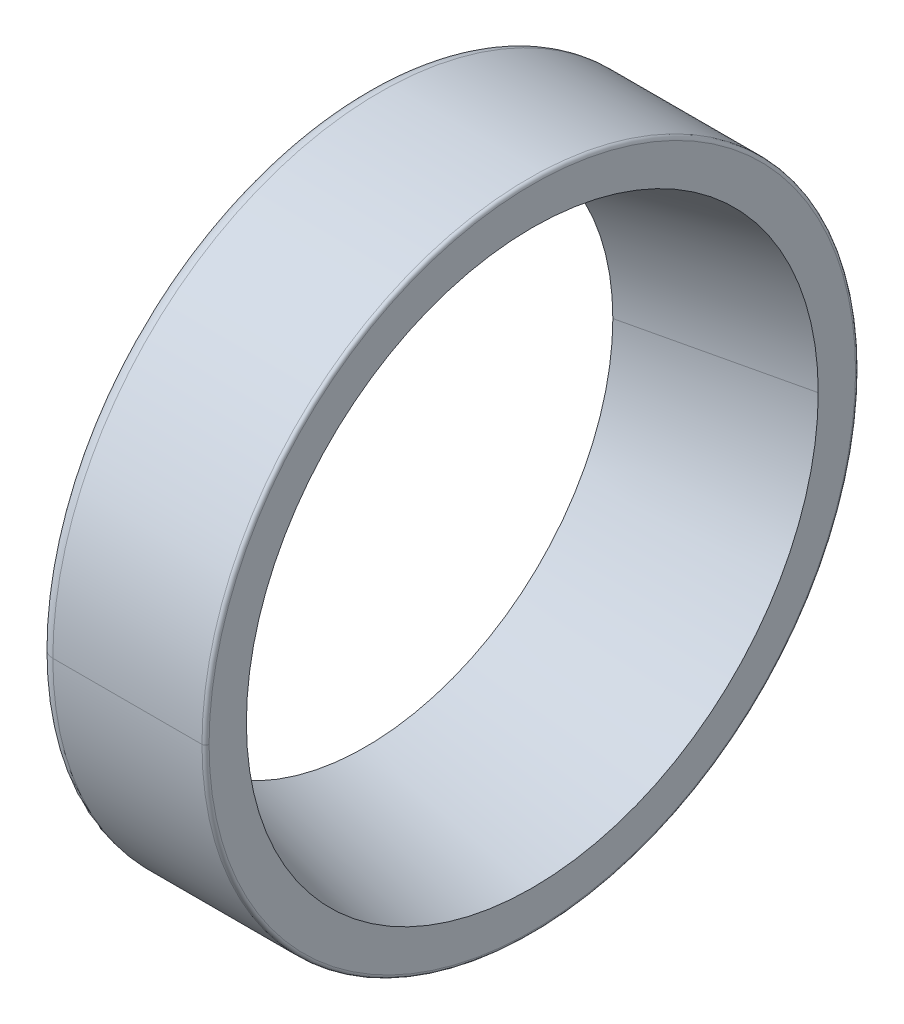
ISO-10303-21;
HEADER;
FILE_DESCRIPTION(('STEP AP214'),'2;1');
FILE_NAME('part.step','',(''),(''),'','','');
FILE_SCHEMA(('AUTOMOTIVE_DESIGN { 1 0 10303 214 1 1 1 1 }'));
ENDSEC;
DATA;
#1=APPLICATION_CONTEXT('core data for automotive mechanical design processes');
#2=APPLICATION_PROTOCOL_DEFINITION('international standard','automotive_design',2000,#1);
#3=PRODUCT_CONTEXT('',#1,'mechanical');
#4=PRODUCT('Part','Part','',(#3));
#5=PRODUCT_RELATED_PRODUCT_CATEGORY('part','',(#4));
#6=PRODUCT_DEFINITION_FORMATION('','',#4);
#7=PRODUCT_DEFINITION_CONTEXT('part definition',#1,'design');
#8=PRODUCT_DEFINITION('design','',#6,#7);
#9=PRODUCT_DEFINITION_SHAPE('','',#8);
#10=(LENGTH_UNIT() NAMED_UNIT(*) SI_UNIT(.MILLI.,.METRE.));
#11=(NAMED_UNIT(*) PLANE_ANGLE_UNIT() SI_UNIT($,.RADIAN.));
#12=(NAMED_UNIT(*) SI_UNIT($,.STERADIAN.) SOLID_ANGLE_UNIT());
#13=UNCERTAINTY_MEASURE_WITH_UNIT(LENGTH_MEASURE(1.E-05),#10,'distance_accuracy_value','');
#14=(GEOMETRIC_REPRESENTATION_CONTEXT(3) GLOBAL_UNCERTAINTY_ASSIGNED_CONTEXT((#13)) GLOBAL_UNIT_ASSIGNED_CONTEXT((#10,
#11,#12)) REPRESENTATION_CONTEXT('',''));
#15=CARTESIAN_POINT('',(0.,0.,0.));
#16=DIRECTION('',(0.,0.,1.));
#17=DIRECTION('',(1.,0.,0.));
#18=AXIS2_PLACEMENT_3D('',#15,#16,#17);
#19=CARTESIAN_POINT('',(10.75,0.,21.9035359271151));
#20=DIRECTION('',(1.,0.,0.));
#21=DIRECTION('',(0.,1.,0.));
#22=AXIS2_PLACEMENT_3D('',#19,#20,#21);
#23=PLANE('',#22);
#24=CARTESIAN_POINT('',(10.75,0.,0.));
#25=DIRECTION('',(-1.,0.,0.));
#26=DIRECTION('',(0.,0.,1.));
#27=AXIS2_PLACEMENT_3D('',#24,#25,#26);
#28=CIRCLE('',#27,23.245);
#29=CARTESIAN_POINT('',(10.75,0.,23.245));
#30=VERTEX_POINT('',#29);
#31=CARTESIAN_POINT('',(10.75,0.,-23.245));
#32=VERTEX_POINT('',#31);
#33=EDGE_CURVE('E61',#30,#32,#28,.T.);
#34=ORIENTED_EDGE('',*,*,#33,.F.);
#35=CARTESIAN_POINT('',(10.75,0.,0.));
#36=DIRECTION('',(-1.,0.,0.));
#37=DIRECTION('',(0.,0.,1.));
#38=AXIS2_PLACEMENT_3D('',#35,#36,#37);
#39=CIRCLE('',#38,23.245);
#40=EDGE_CURVE('E153',#32,#30,#39,.T.);
#41=ORIENTED_EDGE('',*,*,#40,.F.);
#42=EDGE_LOOP('',(#34,#41));
#43=FACE_BOUND('',#42,.T.);
#44=CARTESIAN_POINT('',(10.75,0.,0.));
#45=DIRECTION('',(-1.,0.,0.));
#46=DIRECTION('',(0.,0.,1.));
#47=AXIS2_PLACEMENT_3D('',#44,#45,#46);
#48=CIRCLE('',#47,20.5620718542302);
#49=CARTESIAN_POINT('',(10.75,0.,20.5620718542302));
#50=VERTEX_POINT('',#49);
#51=CARTESIAN_POINT('',(10.75,0.,-20.5620718542302));
#52=VERTEX_POINT('',#51);
#53=EDGE_CURVE('E11',#50,#52,#48,.T.);
#54=ORIENTED_EDGE('',*,*,#53,.T.);
#55=CARTESIAN_POINT('',(10.75,0.,0.));
#56=DIRECTION('',(-1.,0.,0.));
#57=DIRECTION('',(0.,0.,1.));
#58=AXIS2_PLACEMENT_3D('',#55,#56,#57);
#59=CIRCLE('',#58,20.5620718542302);
#60=EDGE_CURVE('E49',#52,#50,#59,.T.);
#61=ORIENTED_EDGE('',*,*,#60,.T.);
#62=EDGE_LOOP('',(#54,#61));
#63=FACE_BOUND('',#62,.T.);
#64=ADVANCED_FACE('F38',(#43,#63),#23,.T.);
#65=CARTESIAN_POINT('',(10.495,0.,0.));
#66=DIRECTION('',(-1.,0.,0.));
#67=DIRECTION('',(0.,0.,1.));
#68=AXIS2_PLACEMENT_3D('',#65,#66,#67);
#69=TOROIDAL_SURFACE('',#68,23.245,0.255);
#70=CARTESIAN_POINT('',(10.495,0.,23.245));
#71=DIRECTION('',(0.,-1.,0.));
#72=DIRECTION('',(0.,0.,1.));
#73=AXIS2_PLACEMENT_3D('',#70,#71,#72);
#74=CIRCLE('',#73,0.255);
#75=CARTESIAN_POINT('',(10.495,0.,23.5));
#76=VERTEX_POINT('',#75);
#77=EDGE_CURVE('E147',#30,#76,#74,.T.);
#78=ORIENTED_EDGE('',*,*,#77,.T.);
#79=CARTESIAN_POINT('',(10.495,0.,0.));
#80=DIRECTION('',(-1.,0.,0.));
#81=DIRECTION('',(0.,0.,1.));
#82=AXIS2_PLACEMENT_3D('',#79,#80,#81);
#83=CIRCLE('',#82,23.5);
#84=CARTESIAN_POINT('',(10.495,0.,-23.5));
#85=VERTEX_POINT('',#84);
#86=EDGE_CURVE('E128',#85,#76,#83,.T.);
#87=ORIENTED_EDGE('',*,*,#86,.F.);
#88=CARTESIAN_POINT('',(10.495,0.,-23.245));
#89=DIRECTION('',(0.,-1.,0.));
#90=DIRECTION('',(0.,0.,-1.));
#91=AXIS2_PLACEMENT_3D('',#88,#89,#90);
#92=CIRCLE('',#91,0.255);
#93=EDGE_CURVE('E155',#85,#32,#92,.T.);
#94=ORIENTED_EDGE('',*,*,#93,.T.);
#95=ORIENTED_EDGE('',*,*,#40,.T.);
#96=EDGE_LOOP('',(#78,#87,#94,#95));
#97=FACE_BOUND('',#96,.T.);
#98=ADVANCED_FACE('F184',(#97),#69,.T.);
#99=CARTESIAN_POINT('',(4.75,0.,0.));
#100=DIRECTION('',(1.,0.,0.));
#101=DIRECTION('',(0.,0.,1.));
#102=AXIS2_PLACEMENT_3D('',#99,#100,#101);
#103=CONICAL_SURFACE('',#102,19.1768529160807,0.226894352079104);
#104=DIRECTION('',(-0.974369716262934,0.,-0.224952563954469));
#105=VECTOR('',#104,1.);
#106=CARTESIAN_POINT('',(4.75,0.,19.1768529160807));
#107=LINE('',#106,#105);
#108=CARTESIAN_POINT('',(-1.25,0.,17.7916339779311));
#109=VERTEX_POINT('',#108);
#110=EDGE_CURVE('E172',#50,#109,#107,.T.);
#111=ORIENTED_EDGE('',*,*,#110,.F.);
#112=ORIENTED_EDGE('',*,*,#60,.F.);
#113=DIRECTION('',(0.974369716262934,0.,-0.224952563954469));
#114=VECTOR('',#113,1.);
#115=CARTESIAN_POINT('',(4.75,0.,-19.1768529160807));
#116=LINE('',#115,#114);
#117=CARTESIAN_POINT('',(-1.25,0.,-17.7916339779311));
#118=VERTEX_POINT('',#117);
#119=EDGE_CURVE('E148',#118,#52,#116,.T.);
#120=ORIENTED_EDGE('',*,*,#119,.F.);
#121=CARTESIAN_POINT('',(-1.25,0.,0.));
#122=DIRECTION('',(-1.,0.,0.));
#123=DIRECTION('',(0.,0.,1.));
#124=AXIS2_PLACEMENT_3D('',#121,#122,#123);
#125=CIRCLE('',#124,17.7916339779311);
#126=EDGE_CURVE('E42',#118,#109,#125,.T.);
#127=ORIENTED_EDGE('',*,*,#126,.T.);
#128=EDGE_LOOP('',(#111,#112,#120,#127));
#129=FACE_BOUND('',#128,.T.);
#130=ADVANCED_FACE('F204',(#129),#103,.F.);
#131=CARTESIAN_POINT('',(4.75,0.,0.));
#132=DIRECTION('',(1.,0.,0.));
#133=DIRECTION('',(0.,0.,1.));
#134=AXIS2_PLACEMENT_3D('',#131,#132,#133);
#135=CONICAL_SURFACE('',#134,19.1768529160807,0.226894352079104);
#136=ORIENTED_EDGE('',*,*,#110,.T.);
#137=CARTESIAN_POINT('',(-1.25,0.,0.));
#138=DIRECTION('',(-1.,0.,0.));
#139=DIRECTION('',(0.,0.,1.));
#140=AXIS2_PLACEMENT_3D('',#137,#138,#139);
#141=CIRCLE('',#140,17.7916339779311);
#142=EDGE_CURVE('E151',#109,#118,#141,.T.);
#143=ORIENTED_EDGE('',*,*,#142,.T.);
#144=ORIENTED_EDGE('',*,*,#119,.T.);
#145=ORIENTED_EDGE('',*,*,#53,.F.);
#146=EDGE_LOOP('',(#136,#143,#144,#145));
#147=FACE_BOUND('',#146,.T.);
#148=ADVANCED_FACE('F197',(#147),#135,.F.);
#149=CARTESIAN_POINT('',(10.495,0.,0.));
#150=DIRECTION('',(-1.,0.,0.));
#151=DIRECTION('',(0.,0.,1.));
#152=AXIS2_PLACEMENT_3D('',#149,#150,#151);
#153=TOROIDAL_SURFACE('',#152,23.245,0.255);
#154=ORIENTED_EDGE('',*,*,#77,.F.);
#155=ORIENTED_EDGE('',*,*,#33,.T.);
#156=ORIENTED_EDGE('',*,*,#93,.F.);
#157=CARTESIAN_POINT('',(10.495,0.,0.));
#158=DIRECTION('',(-1.,0.,0.));
#159=DIRECTION('',(0.,0.,1.));
#160=AXIS2_PLACEMENT_3D('',#157,#158,#159);
#161=CIRCLE('',#160,23.5);
#162=EDGE_CURVE('E124',#76,#85,#161,.T.);
#163=ORIENTED_EDGE('',*,*,#162,.F.);
#164=EDGE_LOOP('',(#154,#155,#156,#163));
#165=FACE_BOUND('',#164,.T.);
#166=ADVANCED_FACE('F190',(#165),#153,.T.);
#167=CARTESIAN_POINT('',(5.1325,0.,0.));
#168=DIRECTION('',(-1.,0.,0.));
#169=DIRECTION('',(0.,0.,1.));
#170=AXIS2_PLACEMENT_3D('',#167,#168,#169);
#171=CYLINDRICAL_SURFACE('',#170,23.5);
#172=DIRECTION('',(-1.,0.,0.));
#173=VECTOR('',#172,1.);
#174=CARTESIAN_POINT('',(5.1325,0.,23.5));
#175=LINE('',#174,#173);
#176=CARTESIAN_POINT('',(-0.23,0.,23.5));
#177=VERTEX_POINT('',#176);
#178=EDGE_CURVE('E140',#76,#177,#175,.T.);
#179=ORIENTED_EDGE('',*,*,#178,.T.);
#180=CARTESIAN_POINT('',(-0.23,0.,0.));
#181=DIRECTION('',(-1.,0.,0.));
#182=DIRECTION('',(0.,0.,1.));
#183=AXIS2_PLACEMENT_3D('',#180,#181,#182);
#184=CIRCLE('',#183,23.5);
#185=CARTESIAN_POINT('',(-0.23,0.,-23.5));
#186=VERTEX_POINT('',#185);
#187=EDGE_CURVE('E132',#186,#177,#184,.T.);
#188=ORIENTED_EDGE('',*,*,#187,.F.);
#189=DIRECTION('',(1.,0.,0.));
#190=VECTOR('',#189,1.);
#191=CARTESIAN_POINT('',(5.1325,0.,-23.5));
#192=LINE('',#191,#190);
#193=EDGE_CURVE('E144',#186,#85,#192,.T.);
#194=ORIENTED_EDGE('',*,*,#193,.T.);
#195=ORIENTED_EDGE('',*,*,#86,.T.);
#196=EDGE_LOOP('',(#179,#188,#194,#195));
#197=FACE_BOUND('',#196,.T.);
#198=ADVANCED_FACE('F40',(#197),#171,.T.);
#199=CARTESIAN_POINT('',(-1.25,0.,20.1358169889656));
#200=DIRECTION('',(-1.,0.,0.));
#201=DIRECTION('',(0.,0.,1.));
#202=AXIS2_PLACEMENT_3D('',#199,#200,#201);
#203=PLANE('',#202);
#204=ORIENTED_EDGE('',*,*,#142,.F.);
#205=ORIENTED_EDGE('',*,*,#126,.F.);
#206=EDGE_LOOP('',(#204,#205));
#207=FACE_BOUND('',#206,.T.);
#208=CARTESIAN_POINT('',(-1.25,0.,0.));
#209=DIRECTION('',(-1.,0.,0.));
#210=DIRECTION('',(0.,0.,1.));
#211=AXIS2_PLACEMENT_3D('',#208,#209,#210);
#212=CIRCLE('',#211,22.48);
#213=CARTESIAN_POINT('',(-1.25,0.,22.48));
#214=VERTEX_POINT('',#213);
#215=CARTESIAN_POINT('',(-1.25,0.,-22.48));
#216=VERTEX_POINT('',#215);
#217=EDGE_CURVE('E123',#214,#216,#212,.T.);
#218=ORIENTED_EDGE('',*,*,#217,.T.);
#219=CARTESIAN_POINT('',(-1.25,0.,0.));
#220=DIRECTION('',(-1.,0.,0.));
#221=DIRECTION('',(0.,0.,1.));
#222=AXIS2_PLACEMENT_3D('',#219,#220,#221);
#223=CIRCLE('',#222,22.48);
#224=EDGE_CURVE('E115',#216,#214,#223,.T.);
#225=ORIENTED_EDGE('',*,*,#224,.T.);
#226=EDGE_LOOP('',(#218,#225));
#227=FACE_BOUND('',#226,.T.);
#228=ADVANCED_FACE('F126',(#207,#227),#203,.T.);
#229=CARTESIAN_POINT('',(5.1325,0.,0.));
#230=DIRECTION('',(-1.,0.,0.));
#231=DIRECTION('',(0.,0.,1.));
#232=AXIS2_PLACEMENT_3D('',#229,#230,#231);
#233=CYLINDRICAL_SURFACE('',#232,23.5);
#234=ORIENTED_EDGE('',*,*,#178,.F.);
#235=ORIENTED_EDGE('',*,*,#162,.T.);
#236=ORIENTED_EDGE('',*,*,#193,.F.);
#237=CARTESIAN_POINT('',(-0.23,0.,0.));
#238=DIRECTION('',(-1.,0.,0.));
#239=DIRECTION('',(0.,0.,1.));
#240=AXIS2_PLACEMENT_3D('',#237,#238,#239);
#241=CIRCLE('',#240,23.5);
#242=EDGE_CURVE('E101',#177,#186,#241,.T.);
#243=ORIENTED_EDGE('',*,*,#242,.F.);
#244=EDGE_LOOP('',(#234,#235,#236,#243));
#245=FACE_BOUND('',#244,.T.);
#246=ADVANCED_FACE('F187',(#245),#233,.T.);
#247=CARTESIAN_POINT('',(-0.229999999999993,0.,0.));
#248=DIRECTION('',(-1.,0.,0.));
#249=DIRECTION('',(0.,0.,1.));
#250=AXIS2_PLACEMENT_3D('',#247,#248,#249);
#251=TOROIDAL_SURFACE('',#250,22.48,1.02);
#252=CARTESIAN_POINT('',(-0.229999999999993,0.,22.48));
#253=DIRECTION('',(0.,-1.,0.));
#254=DIRECTION('',(0.,0.,1.));
#255=AXIS2_PLACEMENT_3D('',#252,#253,#254);
#256=CIRCLE('',#255,1.02);
#257=EDGE_CURVE('E119',#177,#214,#256,.T.);
#258=ORIENTED_EDGE('',*,*,#257,.T.);
#259=ORIENTED_EDGE('',*,*,#224,.F.);
#260=CARTESIAN_POINT('',(-0.229999999999993,0.,-22.48));
#261=DIRECTION('',(0.,-1.,0.));
#262=DIRECTION('',(0.,0.,-1.));
#263=AXIS2_PLACEMENT_3D('',#260,#261,#262);
#264=CIRCLE('',#263,1.02);
#265=EDGE_CURVE('E118',#216,#186,#264,.T.);
#266=ORIENTED_EDGE('',*,*,#265,.T.);
#267=ORIENTED_EDGE('',*,*,#187,.T.);
#268=EDGE_LOOP('',(#258,#259,#266,#267));
#269=FACE_BOUND('',#268,.T.);
#270=ADVANCED_FACE('F117',(#269),#251,.T.);
#271=CARTESIAN_POINT('',(-0.229999999999993,0.,0.));
#272=DIRECTION('',(-1.,0.,0.));
#273=DIRECTION('',(0.,0.,1.));
#274=AXIS2_PLACEMENT_3D('',#271,#272,#273);
#275=TOROIDAL_SURFACE('',#274,22.48,1.02);
#276=ORIENTED_EDGE('',*,*,#257,.F.);
#277=ORIENTED_EDGE('',*,*,#242,.T.);
#278=ORIENTED_EDGE('',*,*,#265,.F.);
#279=ORIENTED_EDGE('',*,*,#217,.F.);
#280=EDGE_LOOP('',(#276,#277,#278,#279));
#281=FACE_BOUND('',#280,.T.);
#282=ADVANCED_FACE('F130',(#281),#275,.T.);
#283=CLOSED_SHELL('',(#64,#98,#130,#148,#166,#198,#228,#246,#270,#282));
#284=MANIFOLD_SOLID_BREP('B2',#283);
#285=ADVANCED_BREP_SHAPE_REPRESENTATION('',(#18,#284),#14);
#286=SHAPE_DEFINITION_REPRESENTATION(#9,#285);
ENDSEC;
END-ISO-10303-21;
